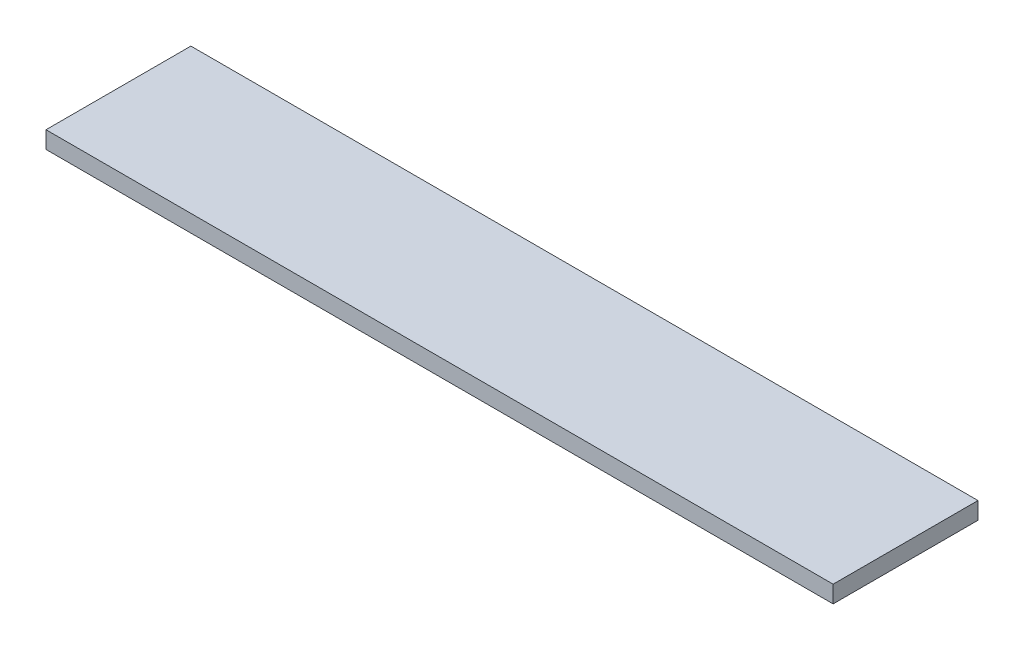
ISO-10303-21;
HEADER;
FILE_DESCRIPTION(('STEP AP214'),'2;1');
FILE_NAME('part.step','',(''),(''),'','','');
FILE_SCHEMA(('AUTOMOTIVE_DESIGN { 1 0 10303 214 1 1 1 1 }'));
ENDSEC;
DATA;
#1=APPLICATION_CONTEXT('core data for automotive mechanical design processes');
#2=APPLICATION_PROTOCOL_DEFINITION('international standard','automotive_design',2000,#1);
#3=PRODUCT_CONTEXT('',#1,'mechanical');
#4=PRODUCT('Part','Part','',(#3));
#5=PRODUCT_RELATED_PRODUCT_CATEGORY('part','',(#4));
#6=PRODUCT_DEFINITION_FORMATION('','',#4);
#7=PRODUCT_DEFINITION_CONTEXT('part definition',#1,'design');
#8=PRODUCT_DEFINITION('design','',#6,#7);
#9=PRODUCT_DEFINITION_SHAPE('','',#8);
#10=(LENGTH_UNIT() NAMED_UNIT(*) SI_UNIT(.MILLI.,.METRE.));
#11=(NAMED_UNIT(*) PLANE_ANGLE_UNIT() SI_UNIT($,.RADIAN.));
#12=(NAMED_UNIT(*) SI_UNIT($,.STERADIAN.) SOLID_ANGLE_UNIT());
#13=UNCERTAINTY_MEASURE_WITH_UNIT(LENGTH_MEASURE(1.E-05),#10,'distance_accuracy_value','');
#14=(GEOMETRIC_REPRESENTATION_CONTEXT(3) GLOBAL_UNCERTAINTY_ASSIGNED_CONTEXT((#13)) GLOBAL_UNIT_ASSIGNED_CONTEXT((#10,
#11,#12)) REPRESENTATION_CONTEXT('',''));
#15=CARTESIAN_POINT('',(0.,0.,0.));
#16=DIRECTION('',(0.,0.,1.));
#17=DIRECTION('',(1.,0.,0.));
#18=AXIS2_PLACEMENT_3D('',#15,#16,#17);
#19=CARTESIAN_POINT('',(-55.201177941683,3.,-19.0623552347233));
#20=DIRECTION('',(1.,0.,0.));
#21=DIRECTION('',(0.,0.,-1.));
#22=AXIS2_PLACEMENT_3D('',#19,#20,#21);
#23=PLANE('',#22);
#24=DIRECTION('',(0.,0.,1.));
#25=VECTOR('',#24,1.);
#26=CARTESIAN_POINT('',(-55.201177941683,0.,-19.0623552347233));
#27=LINE('',#26,#25);
#28=CARTESIAN_POINT('',(-55.201177941683,0.,-19.0623552347233));
#29=VERTEX_POINT('',#28);
#30=CARTESIAN_POINT('',(-55.201177941683,0.,6.33764476527667));
#31=VERTEX_POINT('',#30);
#32=EDGE_CURVE('E96',#29,#31,#27,.T.);
#33=ORIENTED_EDGE('',*,*,#32,.T.);
#34=DIRECTION('',(0.,-1.,0.));
#35=VECTOR('',#34,1.);
#36=CARTESIAN_POINT('',(-55.201177941683,3.,6.33764476527667));
#37=LINE('',#36,#35);
#38=CARTESIAN_POINT('',(-55.201177941683,3.,6.33764476527667));
#39=VERTEX_POINT('',#38);
#40=EDGE_CURVE('E11',#39,#31,#37,.T.);
#41=ORIENTED_EDGE('',*,*,#40,.F.);
#42=DIRECTION('',(0.,0.,1.));
#43=VECTOR('',#42,1.);
#44=CARTESIAN_POINT('',(-55.201177941683,3.,-19.0623552347233));
#45=LINE('',#44,#43);
#46=CARTESIAN_POINT('',(-55.201177941683,3.,-19.0623552347233));
#47=VERTEX_POINT('',#46);
#48=EDGE_CURVE('E84',#47,#39,#45,.T.);
#49=ORIENTED_EDGE('',*,*,#48,.F.);
#50=DIRECTION('',(0.,-1.,0.));
#51=VECTOR('',#50,1.);
#52=CARTESIAN_POINT('',(-55.201177941683,3.,-19.0623552347233));
#53=LINE('',#52,#51);
#54=EDGE_CURVE('E92',#47,#29,#53,.T.);
#55=ORIENTED_EDGE('',*,*,#54,.T.);
#56=EDGE_LOOP('',(#33,#41,#49,#55));
#57=FACE_BOUND('',#56,.T.);
#58=ADVANCED_FACE('F33',(#57),#23,.F.);
#59=CARTESIAN_POINT('',(-55.201177941683,3.,6.33764476527667));
#60=DIRECTION('',(0.,0.,-1.));
#61=DIRECTION('',(-1.,0.,0.));
#62=AXIS2_PLACEMENT_3D('',#59,#60,#61);
#63=PLANE('',#62);
#64=DIRECTION('',(1.,0.,0.));
#65=VECTOR('',#64,1.);
#66=CARTESIAN_POINT('',(-55.201177941683,0.,6.33764476527667));
#67=LINE('',#66,#65);
#68=CARTESIAN_POINT('',(82.798822058317,0.,6.33764476527667));
#69=VERTEX_POINT('',#68);
#70=EDGE_CURVE('E88',#31,#69,#67,.T.);
#71=ORIENTED_EDGE('',*,*,#70,.T.);
#72=DIRECTION('',(0.,-1.,0.));
#73=VECTOR('',#72,1.);
#74=CARTESIAN_POINT('',(82.798822058317,3.,6.33764476527667));
#75=LINE('',#74,#73);
#76=CARTESIAN_POINT('',(82.798822058317,3.,6.33764476527667));
#77=VERTEX_POINT('',#76);
#78=EDGE_CURVE('E41',#77,#69,#75,.T.);
#79=ORIENTED_EDGE('',*,*,#78,.F.);
#80=DIRECTION('',(1.,0.,0.));
#81=VECTOR('',#80,1.);
#82=CARTESIAN_POINT('',(-55.201177941683,3.,6.33764476527667));
#83=LINE('',#82,#81);
#84=EDGE_CURVE('E79',#39,#77,#83,.T.);
#85=ORIENTED_EDGE('',*,*,#84,.F.);
#86=ORIENTED_EDGE('',*,*,#40,.T.);
#87=EDGE_LOOP('',(#71,#79,#85,#86));
#88=FACE_BOUND('',#87,.T.);
#89=ADVANCED_FACE('F87',(#88),#63,.F.);
#90=CARTESIAN_POINT('',(82.798822058317,3.,-19.0623552347233));
#91=DIRECTION('',(-1.,0.,0.));
#92=DIRECTION('',(0.,0.,1.));
#93=AXIS2_PLACEMENT_3D('',#90,#91,#92);
#94=PLANE('',#93);
#95=DIRECTION('',(0.,0.,-1.));
#96=VECTOR('',#95,1.);
#97=CARTESIAN_POINT('',(82.798822058317,0.,-19.0623552347233));
#98=LINE('',#97,#96);
#99=CARTESIAN_POINT('',(82.798822058317,0.,-19.0623552347233));
#100=VERTEX_POINT('',#99);
#101=EDGE_CURVE('E66',#69,#100,#98,.T.);
#102=ORIENTED_EDGE('',*,*,#101,.T.);
#103=DIRECTION('',(0.,-1.,0.));
#104=VECTOR('',#103,1.);
#105=CARTESIAN_POINT('',(82.798822058317,3.,-19.0623552347233));
#106=LINE('',#105,#104);
#107=CARTESIAN_POINT('',(82.798822058317,3.,-19.0623552347233));
#108=VERTEX_POINT('',#107);
#109=EDGE_CURVE('E89',#108,#100,#106,.T.);
#110=ORIENTED_EDGE('',*,*,#109,.F.);
#111=DIRECTION('',(0.,0.,-1.));
#112=VECTOR('',#111,1.);
#113=CARTESIAN_POINT('',(82.798822058317,3.,-19.0623552347233));
#114=LINE('',#113,#112);
#115=EDGE_CURVE('E82',#77,#108,#114,.T.);
#116=ORIENTED_EDGE('',*,*,#115,.F.);
#117=ORIENTED_EDGE('',*,*,#78,.T.);
#118=EDGE_LOOP('',(#102,#110,#116,#117));
#119=FACE_BOUND('',#118,.T.);
#120=ADVANCED_FACE('F90',(#119),#94,.F.);
#121=CARTESIAN_POINT('',(-55.201177941683,3.,-19.0623552347233));
#122=DIRECTION('',(0.,0.,1.));
#123=DIRECTION('',(1.,0.,0.));
#124=AXIS2_PLACEMENT_3D('',#121,#122,#123);
#125=PLANE('',#124);
#126=DIRECTION('',(-1.,0.,0.));
#127=VECTOR('',#126,1.);
#128=CARTESIAN_POINT('',(-55.201177941683,0.,-19.0623552347233));
#129=LINE('',#128,#127);
#130=EDGE_CURVE('E72',#100,#29,#129,.T.);
#131=ORIENTED_EDGE('',*,*,#130,.T.);
#132=ORIENTED_EDGE('',*,*,#54,.F.);
#133=DIRECTION('',(-1.,0.,0.));
#134=VECTOR('',#133,1.);
#135=CARTESIAN_POINT('',(-55.201177941683,3.,-19.0623552347233));
#136=LINE('',#135,#134);
#137=EDGE_CURVE('E49',#108,#47,#136,.T.);
#138=ORIENTED_EDGE('',*,*,#137,.F.);
#139=ORIENTED_EDGE('',*,*,#109,.T.);
#140=EDGE_LOOP('',(#131,#132,#138,#139));
#141=FACE_BOUND('',#140,.T.);
#142=ADVANCED_FACE('F103',(#141),#125,.F.);
#143=CARTESIAN_POINT('',(0.,3.,0.));
#144=DIRECTION('',(0.,1.,0.));
#145=DIRECTION('',(0.,0.,1.));
#146=AXIS2_PLACEMENT_3D('',#143,#144,#145);
#147=PLANE('',#146);
#148=ORIENTED_EDGE('',*,*,#48,.T.);
#149=ORIENTED_EDGE('',*,*,#84,.T.);
#150=ORIENTED_EDGE('',*,*,#115,.T.);
#151=ORIENTED_EDGE('',*,*,#137,.T.);
#152=EDGE_LOOP('',(#148,#149,#150,#151));
#153=FACE_BOUND('',#152,.T.);
#154=ADVANCED_FACE('F80',(#153),#147,.T.);
#155=CARTESIAN_POINT('',(0.,0.,0.));
#156=DIRECTION('',(0.,1.,0.));
#157=DIRECTION('',(0.,0.,1.));
#158=AXIS2_PLACEMENT_3D('',#155,#156,#157);
#159=PLANE('',#158);
#160=ORIENTED_EDGE('',*,*,#32,.F.);
#161=ORIENTED_EDGE('',*,*,#130,.F.);
#162=ORIENTED_EDGE('',*,*,#101,.F.);
#163=ORIENTED_EDGE('',*,*,#70,.F.);
#164=EDGE_LOOP('',(#160,#161,#162,#163));
#165=FACE_BOUND('',#164,.T.);
#166=ADVANCED_FACE('F106',(#165),#159,.F.);
#167=CLOSED_SHELL('',(#58,#89,#120,#142,#154,#166));
#168=MANIFOLD_SOLID_BREP('B2',#167);
#169=ADVANCED_BREP_SHAPE_REPRESENTATION('',(#18,#168),#14);
#170=SHAPE_DEFINITION_REPRESENTATION(#9,#169);
ENDSEC;
END-ISO-10303-21;
